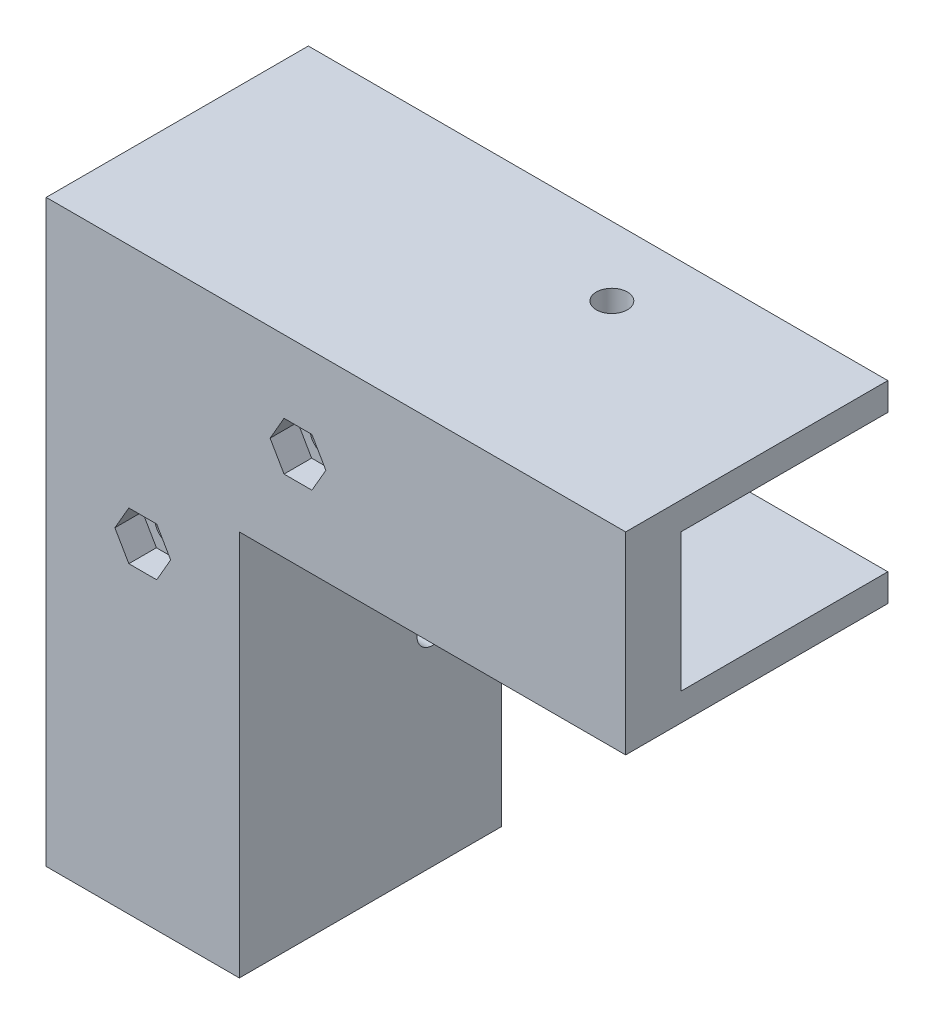
ISO-10303-21;
HEADER;
FILE_DESCRIPTION(('STEP AP214'),'2;1');
FILE_NAME('part.step','',(''),(''),'','','');
FILE_SCHEMA(('AUTOMOTIVE_DESIGN { 1 0 10303 214 1 1 1 1 }'));
ENDSEC;
DATA;
#1=APPLICATION_CONTEXT('core data for automotive mechanical design processes');
#2=APPLICATION_PROTOCOL_DEFINITION('international standard','automotive_design',2000,#1);
#3=PRODUCT_CONTEXT('',#1,'mechanical');
#4=PRODUCT('Part','Part','',(#3));
#5=PRODUCT_RELATED_PRODUCT_CATEGORY('part','',(#4));
#6=PRODUCT_DEFINITION_FORMATION('','',#4);
#7=PRODUCT_DEFINITION_CONTEXT('part definition',#1,'design');
#8=PRODUCT_DEFINITION('design','',#6,#7);
#9=PRODUCT_DEFINITION_SHAPE('','',#8);
#10=(LENGTH_UNIT() NAMED_UNIT(*) SI_UNIT(.MILLI.,.METRE.));
#11=(NAMED_UNIT(*) PLANE_ANGLE_UNIT() SI_UNIT($,.RADIAN.));
#12=(NAMED_UNIT(*) SI_UNIT($,.STERADIAN.) SOLID_ANGLE_UNIT());
#13=UNCERTAINTY_MEASURE_WITH_UNIT(LENGTH_MEASURE(1.E-05),#10,'distance_accuracy_value','');
#14=(GEOMETRIC_REPRESENTATION_CONTEXT(3) GLOBAL_UNCERTAINTY_ASSIGNED_CONTEXT((#13)) GLOBAL_UNIT_ASSIGNED_CONTEXT((#10,
#11,#12)) REPRESENTATION_CONTEXT('',''));
#15=CARTESIAN_POINT('',(0.,0.,0.));
#16=DIRECTION('',(0.,0.,1.));
#17=DIRECTION('',(1.,0.,0.));
#18=AXIS2_PLACEMENT_3D('',#15,#16,#17);
#19=CARTESIAN_POINT('',(0.,0.,8.));
#20=DIRECTION('',(0.,0.,1.));
#21=DIRECTION('',(1.,0.,0.));
#22=AXIS2_PLACEMENT_3D('',#19,#20,#21);
#23=PLANE('',#22);
#24=DIRECTION('',(1.,0.,0.));
#25=VECTOR('',#24,1.);
#26=CARTESIAN_POINT('',(-20.,0.,8.));
#27=LINE('',#26,#25);
#28=CARTESIAN_POINT('',(-24.,0.,8.));
#29=VERTEX_POINT('',#28);
#30=CARTESIAN_POINT('',(4.,0.,8.));
#31=VERTEX_POINT('',#30);
#32=EDGE_CURVE('E395',#29,#31,#27,.T.);
#33=ORIENTED_EDGE('',*,*,#32,.T.);
#34=DIRECTION('',(0.,1.,0.));
#35=VECTOR('',#34,1.);
#36=CARTESIAN_POINT('',(3.99999999999999,56.,8.));
#37=LINE('',#36,#35);
#38=CARTESIAN_POINT('',(3.99999999999999,56.,8.));
#39=VERTEX_POINT('',#38);
#40=EDGE_CURVE('E247',#31,#39,#37,.T.);
#41=ORIENTED_EDGE('',*,*,#40,.T.);
#42=DIRECTION('',(1.,0.,0.));
#43=VECTOR('',#42,1.);
#44=CARTESIAN_POINT('',(60.,56.,8.));
#45=LINE('',#44,#43);
#46=CARTESIAN_POINT('',(60.,56.,8.));
#47=VERTEX_POINT('',#46);
#48=EDGE_CURVE('E261',#39,#47,#45,.T.);
#49=ORIENTED_EDGE('',*,*,#48,.T.);
#50=DIRECTION('',(0.,1.,0.));
#51=VECTOR('',#50,1.);
#52=CARTESIAN_POINT('',(60.,60.,8.));
#53=LINE('',#52,#51);
#54=CARTESIAN_POINT('',(60.,84.,8.));
#55=VERTEX_POINT('',#54);
#56=EDGE_CURVE('E397',#47,#55,#53,.T.);
#57=ORIENTED_EDGE('',*,*,#56,.T.);
#58=DIRECTION('',(-1.,0.,0.));
#59=VECTOR('',#58,1.);
#60=CARTESIAN_POINT('',(60.,84.,8.));
#61=LINE('',#60,#59);
#62=CARTESIAN_POINT('',(-24.,84.,8.));
#63=VERTEX_POINT('',#62);
#64=EDGE_CURVE('E230',#55,#63,#61,.T.);
#65=ORIENTED_EDGE('',*,*,#64,.T.);
#66=DIRECTION('',(0.,-1.,0.));
#67=VECTOR('',#66,1.);
#68=CARTESIAN_POINT('',(-24.,84.,8.));
#69=LINE('',#68,#67);
#70=EDGE_CURVE('E227',#63,#29,#69,.T.);
#71=ORIENTED_EDGE('',*,*,#70,.T.);
#72=EDGE_LOOP('',(#33,#41,#49,#57,#65,#71));
#73=FACE_BOUND('',#72,.T.);
#74=DIRECTION('',(-1.,0.,0.));
#75=VECTOR('',#74,1.);
#76=CARTESIAN_POINT('',(0.,66.5,8.));
#77=LINE('',#76,#75);
#78=CARTESIAN_POINT('',(14.5207259421637,66.5,8.));
#79=VERTEX_POINT('',#78);
#80=CARTESIAN_POINT('',(10.4792740578363,66.5,8.));
#81=VERTEX_POINT('',#80);
#82=EDGE_CURVE('E367',#79,#81,#77,.T.);
#83=ORIENTED_EDGE('',*,*,#82,.T.);
#84=DIRECTION('',(-0.5,0.866025403784439,0.));
#85=VECTOR('',#84,1.);
#86=CARTESIAN_POINT('',(36.6548002192098,21.1626587736527,8.));
#87=LINE('',#86,#85);
#88=CARTESIAN_POINT('',(8.45854811567259,70.,8.));
#89=VERTEX_POINT('',#88);
#90=EDGE_CURVE('E339',#81,#89,#87,.T.);
#91=ORIENTED_EDGE('',*,*,#90,.T.);
#92=DIRECTION('',(0.499999999999996,0.866025403784441,0.));
#93=VECTOR('',#92,1.);
#94=CARTESIAN_POINT('',(-23.9669780457007,13.837341226347,8.));
#95=LINE('',#94,#93);
#96=CARTESIAN_POINT('',(10.4792740578363,73.5,8.));
#97=VERTEX_POINT('',#96);
#98=EDGE_CURVE('E354',#89,#97,#95,.T.);
#99=ORIENTED_EDGE('',*,*,#98,.T.);
#100=DIRECTION('',(1.,0.,0.));
#101=VECTOR('',#100,1.);
#102=CARTESIAN_POINT('',(0.,73.5,8.));
#103=LINE('',#102,#101);
#104=CARTESIAN_POINT('',(14.5207259421637,73.5,8.));
#105=VERTEX_POINT('',#104);
#106=EDGE_CURVE('E376',#97,#105,#103,.T.);
#107=ORIENTED_EDGE('',*,*,#106,.T.);
#108=DIRECTION('',(0.5,-0.866025403784439,0.));
#109=VECTOR('',#108,1.);
#110=CARTESIAN_POINT('',(42.7169780457009,24.6626587736527,8.));
#111=LINE('',#110,#109);
#112=CARTESIAN_POINT('',(16.5414518843274,70.,8.));
#113=VERTEX_POINT('',#112);
#114=EDGE_CURVE('E373',#105,#113,#111,.T.);
#115=ORIENTED_EDGE('',*,*,#114,.T.);
#116=DIRECTION('',(-0.500000000000001,-0.866025403784438,0.));
#117=VECTOR('',#116,1.);
#118=CARTESIAN_POINT('',(-17.9048002192099,10.3373412263473,8.));
#119=LINE('',#118,#117);
#120=EDGE_CURVE('E370',#113,#79,#119,.T.);
#121=ORIENTED_EDGE('',*,*,#120,.T.);
#122=EDGE_LOOP('',(#83,#91,#99,#107,#115,#121));
#123=FACE_BOUND('',#122,.T.);
#124=DIRECTION('',(-1.,0.,0.));
#125=VECTOR('',#124,1.);
#126=CARTESIAN_POINT('',(0.,44.,8.));
#127=LINE('',#126,#125);
#128=CARTESIAN_POINT('',(-7.97927405783629,44.,8.));
#129=VERTEX_POINT('',#128);
#130=CARTESIAN_POINT('',(-12.0207259421637,44.,8.));
#131=VERTEX_POINT('',#130);
#132=EDGE_CURVE('E322',#129,#131,#127,.T.);
#133=ORIENTED_EDGE('',*,*,#132,.T.);
#134=DIRECTION('',(-0.5,0.866025403784439,0.));
#135=VECTOR('',#134,1.);
#136=CARTESIAN_POINT('',(10.0370144266349,5.79487298107779,8.));
#137=LINE('',#136,#135);
#138=CARTESIAN_POINT('',(-14.0414518843274,47.5,8.));
#139=VERTEX_POINT('',#138);
#140=EDGE_CURVE('E302',#131,#139,#137,.T.);
#141=ORIENTED_EDGE('',*,*,#140,.T.);
#142=DIRECTION('',(0.5,0.866025403784438,0.));
#143=VECTOR('',#142,1.);
#144=CARTESIAN_POINT('',(-31.099192253126,17.9551270189222,8.));
#145=LINE('',#144,#143);
#146=CARTESIAN_POINT('',(-12.0207259421637,51.,8.));
#147=VERTEX_POINT('',#146);
#148=EDGE_CURVE('E309',#139,#147,#145,.T.);
#149=ORIENTED_EDGE('',*,*,#148,.T.);
#150=DIRECTION('',(1.,0.,0.));
#151=VECTOR('',#150,1.);
#152=CARTESIAN_POINT('',(-1.75126958938504E-13,51.,8.));
#153=LINE('',#152,#151);
#154=CARTESIAN_POINT('',(-7.97927405783632,51.,8.));
#155=VERTEX_POINT('',#154);
#156=EDGE_CURVE('E331',#147,#155,#153,.T.);
#157=ORIENTED_EDGE('',*,*,#156,.T.);
#158=DIRECTION('',(0.5,-0.866025403784439,0.));
#159=VECTOR('',#158,1.);
#160=CARTESIAN_POINT('',(16.0991922531259,9.29487298107778,8.));
#161=LINE('',#160,#159);
#162=CARTESIAN_POINT('',(-5.95854811567261,47.5,8.));
#163=VERTEX_POINT('',#162);
#164=EDGE_CURVE('E328',#155,#163,#161,.T.);
#165=ORIENTED_EDGE('',*,*,#164,.T.);
#166=DIRECTION('',(-0.499999999999999,-0.866025403784439,0.));
#167=VECTOR('',#166,1.);
#168=CARTESIAN_POINT('',(-25.0370144266349,14.4551270189221,8.));
#169=LINE('',#168,#167);
#170=EDGE_CURVE('E325',#163,#129,#169,.T.);
#171=ORIENTED_EDGE('',*,*,#170,.T.);
#172=EDGE_LOOP('',(#133,#141,#149,#157,#165,#171));
#173=FACE_BOUND('',#172,.T.);
#174=ADVANCED_FACE('F33',(#73,#123,#173),#23,.T.);
#175=CARTESIAN_POINT('',(-20.,0.,8.));
#176=DIRECTION('',(0.,1.,0.));
#177=DIRECTION('',(0.,0.,1.));
#178=AXIS2_PLACEMENT_3D('',#175,#176,#177);
#179=PLANE('',#178);
#180=DIRECTION('',(1.,0.,0.));
#181=VECTOR('',#180,1.);
#182=CARTESIAN_POINT('',(-20.,0.,0.));
#183=LINE('',#182,#181);
#184=CARTESIAN_POINT('',(-20.,0.,0.));
#185=VERTEX_POINT('',#184);
#186=CARTESIAN_POINT('',(0.,0.,0.));
#187=VERTEX_POINT('',#186);
#188=EDGE_CURVE('E384',#185,#187,#183,.T.);
#189=ORIENTED_EDGE('',*,*,#188,.T.);
#190=DIRECTION('',(0.,0.,1.));
#191=VECTOR('',#190,1.);
#192=CARTESIAN_POINT('',(0.,0.,-30.));
#193=LINE('',#192,#191);
#194=CARTESIAN_POINT('',(0.,0.,-30.));
#195=VERTEX_POINT('',#194);
#196=EDGE_CURVE('E280',#195,#187,#193,.T.);
#197=ORIENTED_EDGE('',*,*,#196,.F.);
#198=DIRECTION('',(1.,0.,0.));
#199=VECTOR('',#198,1.);
#200=CARTESIAN_POINT('',(4.,0.,-30.));
#201=LINE('',#200,#199);
#202=CARTESIAN_POINT('',(4.,0.,-30.));
#203=VERTEX_POINT('',#202);
#204=EDGE_CURVE('E257',#195,#203,#201,.T.);
#205=ORIENTED_EDGE('',*,*,#204,.T.);
#206=DIRECTION('',(0.,0.,1.));
#207=VECTOR('',#206,1.);
#208=CARTESIAN_POINT('',(4.,0.,-30.));
#209=LINE('',#208,#207);
#210=EDGE_CURVE('E275',#203,#31,#209,.T.);
#211=ORIENTED_EDGE('',*,*,#210,.T.);
#212=ORIENTED_EDGE('',*,*,#32,.F.);
#213=DIRECTION('',(0.,0.,1.));
#214=VECTOR('',#213,1.);
#215=CARTESIAN_POINT('',(-24.,0.,-30.));
#216=LINE('',#215,#214);
#217=CARTESIAN_POINT('',(-24.,0.,-30.));
#218=VERTEX_POINT('',#217);
#219=EDGE_CURVE('E251',#218,#29,#216,.T.);
#220=ORIENTED_EDGE('',*,*,#219,.F.);
#221=DIRECTION('',(1.,0.,0.));
#222=VECTOR('',#221,1.);
#223=CARTESIAN_POINT('',(-24.,0.,-30.));
#224=LINE('',#223,#222);
#225=CARTESIAN_POINT('',(-20.,0.,-30.));
#226=VERTEX_POINT('',#225);
#227=EDGE_CURVE('E240',#218,#226,#224,.T.);
#228=ORIENTED_EDGE('',*,*,#227,.T.);
#229=DIRECTION('',(0.,0.,1.));
#230=VECTOR('',#229,1.);
#231=CARTESIAN_POINT('',(-20.,0.,-30.));
#232=LINE('',#231,#230);
#233=EDGE_CURVE('E248',#226,#185,#232,.T.);
#234=ORIENTED_EDGE('',*,*,#233,.T.);
#235=EDGE_LOOP('',(#189,#197,#205,#211,#212,#220,#228,#234));
#236=FACE_BOUND('',#235,.T.);
#237=ADVANCED_FACE('F433',(#236),#179,.F.);
#238=CARTESIAN_POINT('',(60.,60.,8.));
#239=DIRECTION('',(-1.,0.,0.));
#240=DIRECTION('',(0.,0.,1.));
#241=AXIS2_PLACEMENT_3D('',#238,#239,#240);
#242=PLANE('',#241);
#243=DIRECTION('',(0.,1.,0.));
#244=VECTOR('',#243,1.);
#245=CARTESIAN_POINT('',(60.,60.,0.));
#246=LINE('',#245,#244);
#247=CARTESIAN_POINT('',(60.,60.,0.));
#248=VERTEX_POINT('',#247);
#249=CARTESIAN_POINT('',(60.,80.,0.));
#250=VERTEX_POINT('',#249);
#251=EDGE_CURVE('E205',#248,#250,#246,.T.);
#252=ORIENTED_EDGE('',*,*,#251,.T.);
#253=DIRECTION('',(0.,0.,1.));
#254=VECTOR('',#253,1.);
#255=CARTESIAN_POINT('',(60.,80.,-30.));
#256=LINE('',#255,#254);
#257=CARTESIAN_POINT('',(60.,80.,-30.));
#258=VERTEX_POINT('',#257);
#259=EDGE_CURVE('E198',#258,#250,#256,.T.);
#260=ORIENTED_EDGE('',*,*,#259,.F.);
#261=DIRECTION('',(0.,1.,0.));
#262=VECTOR('',#261,1.);
#263=CARTESIAN_POINT('',(60.,80.,-30.));
#264=LINE('',#263,#262);
#265=CARTESIAN_POINT('',(60.,84.,-30.));
#266=VERTEX_POINT('',#265);
#267=EDGE_CURVE('E202',#258,#266,#264,.T.);
#268=ORIENTED_EDGE('',*,*,#267,.T.);
#269=DIRECTION('',(0.,0.,1.));
#270=VECTOR('',#269,1.);
#271=CARTESIAN_POINT('',(60.,84.,-30.));
#272=LINE('',#271,#270);
#273=EDGE_CURVE('E210',#266,#55,#272,.T.);
#274=ORIENTED_EDGE('',*,*,#273,.T.);
#275=ORIENTED_EDGE('',*,*,#56,.F.);
#276=DIRECTION('',(0.,0.,1.));
#277=VECTOR('',#276,1.);
#278=CARTESIAN_POINT('',(60.,56.,-30.));
#279=LINE('',#278,#277);
#280=CARTESIAN_POINT('',(60.,56.,-30.));
#281=VERTEX_POINT('',#280);
#282=EDGE_CURVE('E286',#281,#47,#279,.T.);
#283=ORIENTED_EDGE('',*,*,#282,.F.);
#284=DIRECTION('',(0.,1.,0.));
#285=VECTOR('',#284,1.);
#286=CARTESIAN_POINT('',(60.,60.,-30.));
#287=LINE('',#286,#285);
#288=CARTESIAN_POINT('',(60.,60.,-30.));
#289=VERTEX_POINT('',#288);
#290=EDGE_CURVE('E267',#281,#289,#287,.T.);
#291=ORIENTED_EDGE('',*,*,#290,.T.);
#292=DIRECTION('',(0.,0.,1.));
#293=VECTOR('',#292,1.);
#294=CARTESIAN_POINT('',(60.,60.,-30.));
#295=LINE('',#294,#293);
#296=EDGE_CURVE('E284',#289,#248,#295,.T.);
#297=ORIENTED_EDGE('',*,*,#296,.T.);
#298=EDGE_LOOP('',(#252,#260,#268,#274,#275,#283,#291,#297));
#299=FACE_BOUND('',#298,.T.);
#300=ADVANCED_FACE('F200',(#299),#242,.F.);
#301=CARTESIAN_POINT('',(0.,0.,0.));
#302=DIRECTION('',(0.,0.,1.));
#303=DIRECTION('',(1.,0.,0.));
#304=AXIS2_PLACEMENT_3D('',#301,#302,#303);
#305=PLANE('',#304);
#306=CARTESIAN_POINT('',(12.5,70.,0.));
#307=DIRECTION('',(0.,0.,1.));
#308=DIRECTION('',(1.,0.,0.));
#309=AXIS2_PLACEMENT_3D('',#306,#307,#308);
#310=CIRCLE('',#309,2.25);
#311=CARTESIAN_POINT('',(14.75,70.,0.));
#312=VERTEX_POINT('',#311);
#313=EDGE_CURVE('E293',#312,#312,#310,.T.);
#314=ORIENTED_EDGE('',*,*,#313,.T.);
#315=EDGE_LOOP('',(#314));
#316=FACE_BOUND('',#315,.T.);
#317=CARTESIAN_POINT('',(-10.,47.5,0.));
#318=DIRECTION('',(0.,0.,1.));
#319=DIRECTION('',(1.,0.,0.));
#320=AXIS2_PLACEMENT_3D('',#317,#318,#319);
#321=CIRCLE('',#320,2.25);
#322=CARTESIAN_POINT('',(-7.75,47.5,0.));
#323=VERTEX_POINT('',#322);
#324=EDGE_CURVE('E299',#323,#323,#321,.T.);
#325=ORIENTED_EDGE('',*,*,#324,.T.);
#326=EDGE_LOOP('',(#325));
#327=FACE_BOUND('',#326,.T.);
#328=ORIENTED_EDGE('',*,*,#188,.F.);
#329=DIRECTION('',(0.,-1.,0.));
#330=VECTOR('',#329,1.);
#331=CARTESIAN_POINT('',(-20.,80.,0.));
#332=LINE('',#331,#330);
#333=CARTESIAN_POINT('',(-20.,80.,0.));
#334=VERTEX_POINT('',#333);
#335=EDGE_CURVE('E398',#334,#185,#332,.T.);
#336=ORIENTED_EDGE('',*,*,#335,.F.);
#337=DIRECTION('',(-1.,0.,0.));
#338=VECTOR('',#337,1.);
#339=CARTESIAN_POINT('',(60.,80.,0.));
#340=LINE('',#339,#338);
#341=EDGE_CURVE('E408',#250,#334,#340,.T.);
#342=ORIENTED_EDGE('',*,*,#341,.F.);
#343=ORIENTED_EDGE('',*,*,#251,.F.);
#344=DIRECTION('',(1.,0.,0.));
#345=VECTOR('',#344,1.);
#346=CARTESIAN_POINT('',(0.,60.,0.));
#347=LINE('',#346,#345);
#348=CARTESIAN_POINT('',(6.,60.,0.));
#349=VERTEX_POINT('',#348);
#350=EDGE_CURVE('E405',#349,#248,#347,.T.);
#351=ORIENTED_EDGE('',*,*,#350,.F.);
#352=CARTESIAN_POINT('',(6.,54.,0.));
#353=DIRECTION('',(0.,0.,1.));
#354=DIRECTION('',(1.,0.,0.));
#355=AXIS2_PLACEMENT_3D('',#352,#353,#354);
#356=CIRCLE('',#355,6.);
#357=CARTESIAN_POINT('',(0.,54.,0.));
#358=VERTEX_POINT('',#357);
#359=EDGE_CURVE('E11',#349,#358,#356,.T.);
#360=ORIENTED_EDGE('',*,*,#359,.T.);
#361=DIRECTION('',(0.,1.,0.));
#362=VECTOR('',#361,1.);
#363=CARTESIAN_POINT('',(0.,0.,0.));
#364=LINE('',#363,#362);
#365=EDGE_CURVE('E403',#187,#358,#364,.T.);
#366=ORIENTED_EDGE('',*,*,#365,.F.);
#367=EDGE_LOOP('',(#328,#336,#342,#343,#351,#360,#366));
#368=FACE_BOUND('',#367,.T.);
#369=ADVANCED_FACE('F445',(#316,#327,#368),#305,.F.);
#370=CARTESIAN_POINT('',(36.6548002192098,21.1626587736527,4.));
#371=DIRECTION('',(0.866025403784439,0.5,0.));
#372=DIRECTION('',(-0.5,0.866025403784439,0.));
#373=AXIS2_PLACEMENT_3D('',#370,#371,#372);
#374=PLANE('',#373);
#375=ORIENTED_EDGE('',*,*,#90,.F.);
#376=DIRECTION('',(0.,0.,1.));
#377=VECTOR('',#376,1.);
#378=CARTESIAN_POINT('',(10.4792740578363,66.5,4.));
#379=LINE('',#378,#377);
#380=CARTESIAN_POINT('',(10.4792740578363,66.5,4.));
#381=VERTEX_POINT('',#380);
#382=EDGE_CURVE('E364',#381,#81,#379,.T.);
#383=ORIENTED_EDGE('',*,*,#382,.F.);
#384=DIRECTION('',(-0.5,0.866025403784439,0.));
#385=VECTOR('',#384,1.);
#386=CARTESIAN_POINT('',(36.6548002192098,21.1626587736527,4.));
#387=LINE('',#386,#385);
#388=CARTESIAN_POINT('',(8.45854811567259,70.,4.));
#389=VERTEX_POINT('',#388);
#390=EDGE_CURVE('E350',#381,#389,#387,.T.);
#391=ORIENTED_EDGE('',*,*,#390,.T.);
#392=DIRECTION('',(0.,0.,1.));
#393=VECTOR('',#392,1.);
#394=CARTESIAN_POINT('',(8.45854811567259,70.,4.));
#395=LINE('',#394,#393);
#396=EDGE_CURVE('E381',#389,#89,#395,.T.);
#397=ORIENTED_EDGE('',*,*,#396,.T.);
#398=EDGE_LOOP('',(#375,#383,#391,#397));
#399=FACE_BOUND('',#398,.T.);
#400=ADVANCED_FACE('F443',(#399),#374,.T.);
#401=CARTESIAN_POINT('',(-23.9669780457007,13.837341226347,4.));
#402=DIRECTION('',(0.866025403784441,-0.499999999999996,0.));
#403=DIRECTION('',(0.499999999999996,0.866025403784441,0.));
#404=AXIS2_PLACEMENT_3D('',#401,#402,#403);
#405=PLANE('',#404);
#406=ORIENTED_EDGE('',*,*,#98,.F.);
#407=ORIENTED_EDGE('',*,*,#396,.F.);
#408=DIRECTION('',(0.499999999999996,0.866025403784441,0.));
#409=VECTOR('',#408,1.);
#410=CARTESIAN_POINT('',(-23.9669780457007,13.837341226347,4.));
#411=LINE('',#410,#409);
#412=CARTESIAN_POINT('',(10.4792740578363,73.5,4.));
#413=VERTEX_POINT('',#412);
#414=EDGE_CURVE('E362',#389,#413,#411,.T.);
#415=ORIENTED_EDGE('',*,*,#414,.T.);
#416=DIRECTION('',(0.,0.,1.));
#417=VECTOR('',#416,1.);
#418=CARTESIAN_POINT('',(10.4792740578363,73.5,4.));
#419=LINE('',#418,#417);
#420=EDGE_CURVE('E385',#413,#97,#419,.T.);
#421=ORIENTED_EDGE('',*,*,#420,.T.);
#422=EDGE_LOOP('',(#406,#407,#415,#421));
#423=FACE_BOUND('',#422,.T.);
#424=ADVANCED_FACE('F467',(#423),#405,.T.);
#425=CARTESIAN_POINT('',(0.,73.5,4.));
#426=DIRECTION('',(0.,-1.,0.));
#427=DIRECTION('',(0.,0.,-1.));
#428=AXIS2_PLACEMENT_3D('',#425,#426,#427);
#429=PLANE('',#428);
#430=ORIENTED_EDGE('',*,*,#106,.F.);
#431=ORIENTED_EDGE('',*,*,#420,.F.);
#432=DIRECTION('',(1.,0.,0.));
#433=VECTOR('',#432,1.);
#434=CARTESIAN_POINT('',(0.,73.5,4.));
#435=LINE('',#434,#433);
#436=CARTESIAN_POINT('',(14.5207259421637,73.5,4.));
#437=VERTEX_POINT('',#436);
#438=EDGE_CURVE('E360',#413,#437,#435,.T.);
#439=ORIENTED_EDGE('',*,*,#438,.T.);
#440=DIRECTION('',(0.,0.,1.));
#441=VECTOR('',#440,1.);
#442=CARTESIAN_POINT('',(14.5207259421637,73.5,4.));
#443=LINE('',#442,#441);
#444=EDGE_CURVE('E387',#437,#105,#443,.T.);
#445=ORIENTED_EDGE('',*,*,#444,.T.);
#446=EDGE_LOOP('',(#430,#431,#439,#445));
#447=FACE_BOUND('',#446,.T.);
#448=ADVANCED_FACE('F474',(#447),#429,.T.);
#449=CARTESIAN_POINT('',(42.7169780457009,24.6626587736527,4.));
#450=DIRECTION('',(-0.866025403784439,-0.5,0.));
#451=DIRECTION('',(0.5,-0.866025403784439,0.));
#452=AXIS2_PLACEMENT_3D('',#449,#450,#451);
#453=PLANE('',#452);
#454=ORIENTED_EDGE('',*,*,#114,.F.);
#455=ORIENTED_EDGE('',*,*,#444,.F.);
#456=DIRECTION('',(0.5,-0.866025403784439,0.));
#457=VECTOR('',#456,1.);
#458=CARTESIAN_POINT('',(42.7169780457009,24.6626587736527,4.));
#459=LINE('',#458,#457);
#460=CARTESIAN_POINT('',(16.5414518843274,70.,4.));
#461=VERTEX_POINT('',#460);
#462=EDGE_CURVE('E358',#437,#461,#459,.T.);
#463=ORIENTED_EDGE('',*,*,#462,.T.);
#464=DIRECTION('',(0.,0.,1.));
#465=VECTOR('',#464,1.);
#466=CARTESIAN_POINT('',(16.5414518843274,70.,4.));
#467=LINE('',#466,#465);
#468=EDGE_CURVE('E389',#461,#113,#467,.T.);
#469=ORIENTED_EDGE('',*,*,#468,.T.);
#470=EDGE_LOOP('',(#454,#455,#463,#469));
#471=FACE_BOUND('',#470,.T.);
#472=ADVANCED_FACE('F482',(#471),#453,.T.);
#473=CARTESIAN_POINT('',(-17.9048002192099,10.3373412263473,4.));
#474=DIRECTION('',(-0.866025403784438,0.500000000000001,0.));
#475=DIRECTION('',(-0.500000000000001,-0.866025403784438,0.));
#476=AXIS2_PLACEMENT_3D('',#473,#474,#475);
#477=PLANE('',#476);
#478=ORIENTED_EDGE('',*,*,#120,.F.);
#479=ORIENTED_EDGE('',*,*,#468,.F.);
#480=DIRECTION('',(-0.500000000000001,-0.866025403784438,0.));
#481=VECTOR('',#480,1.);
#482=CARTESIAN_POINT('',(-17.9048002192099,10.3373412263473,4.));
#483=LINE('',#482,#481);
#484=CARTESIAN_POINT('',(14.5207259421637,66.5,4.));
#485=VERTEX_POINT('',#484);
#486=EDGE_CURVE('E356',#461,#485,#483,.T.);
#487=ORIENTED_EDGE('',*,*,#486,.T.);
#488=DIRECTION('',(0.,0.,1.));
#489=VECTOR('',#488,1.);
#490=CARTESIAN_POINT('',(14.5207259421637,66.5,4.));
#491=LINE('',#490,#489);
#492=EDGE_CURVE('E391',#485,#79,#491,.T.);
#493=ORIENTED_EDGE('',*,*,#492,.T.);
#494=EDGE_LOOP('',(#478,#479,#487,#493));
#495=FACE_BOUND('',#494,.T.);
#496=ADVANCED_FACE('F490',(#495),#477,.T.);
#497=CARTESIAN_POINT('',(0.,66.5,4.));
#498=DIRECTION('',(0.,1.,0.));
#499=DIRECTION('',(0.,0.,1.));
#500=AXIS2_PLACEMENT_3D('',#497,#498,#499);
#501=PLANE('',#500);
#502=ORIENTED_EDGE('',*,*,#82,.F.);
#503=ORIENTED_EDGE('',*,*,#492,.F.);
#504=DIRECTION('',(-1.,0.,0.));
#505=VECTOR('',#504,1.);
#506=CARTESIAN_POINT('',(0.,66.5,4.));
#507=LINE('',#506,#505);
#508=EDGE_CURVE('E353',#485,#381,#507,.T.);
#509=ORIENTED_EDGE('',*,*,#508,.T.);
#510=ORIENTED_EDGE('',*,*,#382,.T.);
#511=EDGE_LOOP('',(#502,#503,#509,#510));
#512=FACE_BOUND('',#511,.T.);
#513=ADVANCED_FACE('F498',(#512),#501,.T.);
#514=CARTESIAN_POINT('',(0.,0.,4.));
#515=DIRECTION('',(0.,0.,1.));
#516=DIRECTION('',(1.,0.,0.));
#517=AXIS2_PLACEMENT_3D('',#514,#515,#516);
#518=PLANE('',#517);
#519=CARTESIAN_POINT('',(12.5,70.,4.));
#520=DIRECTION('',(0.,0.,1.));
#521=DIRECTION('',(1.,0.,0.));
#522=AXIS2_PLACEMENT_3D('',#519,#520,#521);
#523=CIRCLE('',#522,2.25);
#524=CARTESIAN_POINT('',(14.75,70.,4.));
#525=VERTEX_POINT('',#524);
#526=EDGE_CURVE('E283',#525,#525,#523,.T.);
#527=ORIENTED_EDGE('',*,*,#526,.F.);
#528=EDGE_LOOP('',(#527));
#529=FACE_BOUND('',#528,.T.);
#530=ORIENTED_EDGE('',*,*,#390,.F.);
#531=ORIENTED_EDGE('',*,*,#508,.F.);
#532=ORIENTED_EDGE('',*,*,#486,.F.);
#533=ORIENTED_EDGE('',*,*,#462,.F.);
#534=ORIENTED_EDGE('',*,*,#438,.F.);
#535=ORIENTED_EDGE('',*,*,#414,.F.);
#536=EDGE_LOOP('',(#530,#531,#532,#533,#534,#535));
#537=FACE_BOUND('',#536,.T.);
#538=ADVANCED_FACE('F506',(#529,#537),#518,.T.);
#539=CARTESIAN_POINT('',(10.0370144266349,5.79487298107779,4.));
#540=DIRECTION('',(0.866025403784439,0.5,0.));
#541=DIRECTION('',(-0.5,0.866025403784439,0.));
#542=AXIS2_PLACEMENT_3D('',#539,#540,#541);
#543=PLANE('',#542);
#544=ORIENTED_EDGE('',*,*,#140,.F.);
#545=DIRECTION('',(0.,0.,1.));
#546=VECTOR('',#545,1.);
#547=CARTESIAN_POINT('',(-12.0207259421637,44.,4.));
#548=LINE('',#547,#546);
#549=CARTESIAN_POINT('',(-12.0207259421637,44.,4.));
#550=VERTEX_POINT('',#549);
#551=EDGE_CURVE('E319',#550,#131,#548,.T.);
#552=ORIENTED_EDGE('',*,*,#551,.F.);
#553=DIRECTION('',(-0.5,0.866025403784439,0.));
#554=VECTOR('',#553,1.);
#555=CARTESIAN_POINT('',(10.0370144266349,5.79487298107779,4.));
#556=LINE('',#555,#554);
#557=CARTESIAN_POINT('',(-14.0414518843274,47.5,4.));
#558=VERTEX_POINT('',#557);
#559=EDGE_CURVE('E305',#550,#558,#556,.T.);
#560=ORIENTED_EDGE('',*,*,#559,.T.);
#561=DIRECTION('',(0.,0.,1.));
#562=VECTOR('',#561,1.);
#563=CARTESIAN_POINT('',(-14.0414518843274,47.5,4.));
#564=LINE('',#563,#562);
#565=EDGE_CURVE('E336',#558,#139,#564,.T.);
#566=ORIENTED_EDGE('',*,*,#565,.T.);
#567=EDGE_LOOP('',(#544,#552,#560,#566));
#568=FACE_BOUND('',#567,.T.);
#569=ADVANCED_FACE('F514',(#568),#543,.T.);
#570=CARTESIAN_POINT('',(-31.099192253126,17.9551270189222,4.));
#571=DIRECTION('',(0.866025403784438,-0.5,0.));
#572=DIRECTION('',(0.5,0.866025403784438,0.));
#573=AXIS2_PLACEMENT_3D('',#570,#571,#572);
#574=PLANE('',#573);
#575=ORIENTED_EDGE('',*,*,#148,.F.);
#576=ORIENTED_EDGE('',*,*,#565,.F.);
#577=DIRECTION('',(0.5,0.866025403784438,0.));
#578=VECTOR('',#577,1.);
#579=CARTESIAN_POINT('',(-31.099192253126,17.9551270189222,4.));
#580=LINE('',#579,#578);
#581=CARTESIAN_POINT('',(-12.0207259421637,51.,4.));
#582=VERTEX_POINT('',#581);
#583=EDGE_CURVE('E317',#558,#582,#580,.T.);
#584=ORIENTED_EDGE('',*,*,#583,.T.);
#585=DIRECTION('',(0.,0.,1.));
#586=VECTOR('',#585,1.);
#587=CARTESIAN_POINT('',(-12.0207259421637,51.,4.));
#588=LINE('',#587,#586);
#589=EDGE_CURVE('E340',#582,#147,#588,.T.);
#590=ORIENTED_EDGE('',*,*,#589,.T.);
#591=EDGE_LOOP('',(#575,#576,#584,#590));
#592=FACE_BOUND('',#591,.T.);
#593=ADVANCED_FACE('F523',(#592),#574,.T.);
#594=CARTESIAN_POINT('',(-1.75126958938504E-13,51.,4.));
#595=DIRECTION('',(0.,-1.,0.));
#596=DIRECTION('',(1.,0.,0.));
#597=AXIS2_PLACEMENT_3D('',#594,#595,#596);
#598=PLANE('',#597);
#599=ORIENTED_EDGE('',*,*,#156,.F.);
#600=ORIENTED_EDGE('',*,*,#589,.F.);
#601=DIRECTION('',(1.,0.,0.));
#602=VECTOR('',#601,1.);
#603=CARTESIAN_POINT('',(-1.75126958938504E-13,51.,4.));
#604=LINE('',#603,#602);
#605=CARTESIAN_POINT('',(-7.97927405783632,51.,4.));
#606=VERTEX_POINT('',#605);
#607=EDGE_CURVE('E315',#582,#606,#604,.T.);
#608=ORIENTED_EDGE('',*,*,#607,.T.);
#609=DIRECTION('',(0.,0.,1.));
#610=VECTOR('',#609,1.);
#611=CARTESIAN_POINT('',(-7.97927405783632,51.,4.));
#612=LINE('',#611,#610);
#613=EDGE_CURVE('E342',#606,#155,#612,.T.);
#614=ORIENTED_EDGE('',*,*,#613,.T.);
#615=EDGE_LOOP('',(#599,#600,#608,#614));
#616=FACE_BOUND('',#615,.T.);
#617=ADVANCED_FACE('F531',(#616),#598,.T.);
#618=CARTESIAN_POINT('',(16.0991922531259,9.29487298107778,4.));
#619=DIRECTION('',(-0.866025403784439,-0.499999999999999,0.));
#620=DIRECTION('',(0.5,-0.866025403784439,0.));
#621=AXIS2_PLACEMENT_3D('',#618,#619,#620);
#622=PLANE('',#621);
#623=ORIENTED_EDGE('',*,*,#164,.F.);
#624=ORIENTED_EDGE('',*,*,#613,.F.);
#625=DIRECTION('',(0.5,-0.866025403784439,0.));
#626=VECTOR('',#625,1.);
#627=CARTESIAN_POINT('',(16.0991922531259,9.29487298107778,4.));
#628=LINE('',#627,#626);
#629=CARTESIAN_POINT('',(-5.95854811567261,47.5,4.));
#630=VERTEX_POINT('',#629);
#631=EDGE_CURVE('E313',#606,#630,#628,.T.);
#632=ORIENTED_EDGE('',*,*,#631,.T.);
#633=DIRECTION('',(0.,0.,1.));
#634=VECTOR('',#633,1.);
#635=CARTESIAN_POINT('',(-5.95854811567261,47.5,4.));
#636=LINE('',#635,#634);
#637=EDGE_CURVE('E344',#630,#163,#636,.T.);
#638=ORIENTED_EDGE('',*,*,#637,.T.);
#639=EDGE_LOOP('',(#623,#624,#632,#638));
#640=FACE_BOUND('',#639,.T.);
#641=ADVANCED_FACE('F539',(#640),#622,.T.);
#642=CARTESIAN_POINT('',(-25.0370144266349,14.4551270189221,4.));
#643=DIRECTION('',(-0.866025403784439,0.499999999999999,0.));
#644=DIRECTION('',(-0.499999999999999,-0.866025403784439,0.));
#645=AXIS2_PLACEMENT_3D('',#642,#643,#644);
#646=PLANE('',#645);
#647=ORIENTED_EDGE('',*,*,#170,.F.);
#648=ORIENTED_EDGE('',*,*,#637,.F.);
#649=DIRECTION('',(-0.499999999999999,-0.866025403784439,0.));
#650=VECTOR('',#649,1.);
#651=CARTESIAN_POINT('',(-25.0370144266349,14.4551270189221,4.));
#652=LINE('',#651,#650);
#653=CARTESIAN_POINT('',(-7.97927405783629,44.,4.));
#654=VERTEX_POINT('',#653);
#655=EDGE_CURVE('E311',#630,#654,#652,.T.);
#656=ORIENTED_EDGE('',*,*,#655,.T.);
#657=DIRECTION('',(0.,0.,1.));
#658=VECTOR('',#657,1.);
#659=CARTESIAN_POINT('',(-7.97927405783629,44.,4.));
#660=LINE('',#659,#658);
#661=EDGE_CURVE('E346',#654,#129,#660,.T.);
#662=ORIENTED_EDGE('',*,*,#661,.T.);
#663=EDGE_LOOP('',(#647,#648,#656,#662));
#664=FACE_BOUND('',#663,.T.);
#665=ADVANCED_FACE('F547',(#664),#646,.T.);
#666=CARTESIAN_POINT('',(0.,44.,4.));
#667=DIRECTION('',(0.,1.,0.));
#668=DIRECTION('',(-1.,0.,0.));
#669=AXIS2_PLACEMENT_3D('',#666,#667,#668);
#670=PLANE('',#669);
#671=ORIENTED_EDGE('',*,*,#132,.F.);
#672=ORIENTED_EDGE('',*,*,#661,.F.);
#673=DIRECTION('',(-1.,0.,0.));
#674=VECTOR('',#673,1.);
#675=CARTESIAN_POINT('',(0.,44.,4.));
#676=LINE('',#675,#674);
#677=EDGE_CURVE('E308',#654,#550,#676,.T.);
#678=ORIENTED_EDGE('',*,*,#677,.T.);
#679=ORIENTED_EDGE('',*,*,#551,.T.);
#680=EDGE_LOOP('',(#671,#672,#678,#679));
#681=FACE_BOUND('',#680,.T.);
#682=ADVANCED_FACE('F555',(#681),#670,.T.);
#683=CARTESIAN_POINT('',(0.,0.,4.));
#684=DIRECTION('',(0.,0.,1.));
#685=DIRECTION('',(1.,0.,0.));
#686=AXIS2_PLACEMENT_3D('',#683,#684,#685);
#687=PLANE('',#686);
#688=CARTESIAN_POINT('',(-10.,47.5,4.));
#689=DIRECTION('',(0.,0.,1.));
#690=DIRECTION('',(1.,0.,0.));
#691=AXIS2_PLACEMENT_3D('',#688,#689,#690);
#692=CIRCLE('',#691,2.25);
#693=CARTESIAN_POINT('',(-7.75,47.5,4.));
#694=VERTEX_POINT('',#693);
#695=EDGE_CURVE('E296',#694,#694,#692,.T.);
#696=ORIENTED_EDGE('',*,*,#695,.F.);
#697=EDGE_LOOP('',(#696));
#698=FACE_BOUND('',#697,.T.);
#699=ORIENTED_EDGE('',*,*,#559,.F.);
#700=ORIENTED_EDGE('',*,*,#677,.F.);
#701=ORIENTED_EDGE('',*,*,#655,.F.);
#702=ORIENTED_EDGE('',*,*,#631,.F.);
#703=ORIENTED_EDGE('',*,*,#607,.F.);
#704=ORIENTED_EDGE('',*,*,#583,.F.);
#705=EDGE_LOOP('',(#699,#700,#701,#702,#703,#704));
#706=FACE_BOUND('',#705,.T.);
#707=ADVANCED_FACE('F562',(#698,#706),#687,.T.);
#708=CARTESIAN_POINT('',(-10.,47.5,0.));
#709=DIRECTION('',(0.,0.,1.));
#710=DIRECTION('',(1.,0.,0.));
#711=AXIS2_PLACEMENT_3D('',#708,#709,#710);
#712=CYLINDRICAL_SURFACE('',#711,2.25);
#713=ORIENTED_EDGE('',*,*,#324,.F.);
#714=EDGE_LOOP('',(#713));
#715=FACE_BOUND('',#714,.T.);
#716=ORIENTED_EDGE('',*,*,#695,.T.);
#717=EDGE_LOOP('',(#716));
#718=FACE_BOUND('',#717,.T.);
#719=ADVANCED_FACE('F569',(#715,#718),#712,.F.);
#720=CARTESIAN_POINT('',(12.5,70.,0.));
#721=DIRECTION('',(0.,0.,1.));
#722=DIRECTION('',(1.,0.,0.));
#723=AXIS2_PLACEMENT_3D('',#720,#721,#722);
#724=CYLINDRICAL_SURFACE('',#723,2.25);
#725=ORIENTED_EDGE('',*,*,#313,.F.);
#726=EDGE_LOOP('',(#725));
#727=FACE_BOUND('',#726,.T.);
#728=ORIENTED_EDGE('',*,*,#526,.T.);
#729=EDGE_LOOP('',(#728));
#730=FACE_BOUND('',#729,.T.);
#731=ADVANCED_FACE('F577',(#727,#730),#724,.F.);
#732=CARTESIAN_POINT('',(0.,0.,-30.));
#733=DIRECTION('',(-1.,0.,0.));
#734=DIRECTION('',(0.,0.,1.));
#735=AXIS2_PLACEMENT_3D('',#732,#733,#734);
#736=PLANE('',#735);
#737=CARTESIAN_POINT('',(0.,30.,-20.));
#738=DIRECTION('',(-1.,0.,0.));
#739=DIRECTION('',(0.,0.,1.));
#740=AXIS2_PLACEMENT_3D('',#737,#738,#739);
#741=CIRCLE('',#740,2.25);
#742=CARTESIAN_POINT('',(0.,30.,-17.75));
#743=VERTEX_POINT('',#742);
#744=EDGE_CURVE('E787',#743,#743,#741,.T.);
#745=ORIENTED_EDGE('',*,*,#744,.F.);
#746=EDGE_LOOP('',(#745));
#747=FACE_BOUND('',#746,.T.);
#748=ORIENTED_EDGE('',*,*,#365,.T.);
#749=DIRECTION('',(0.,0.,1.));
#750=VECTOR('',#749,1.);
#751=CARTESIAN_POINT('',(0.,54.,-30.));
#752=LINE('',#751,#750);
#753=CARTESIAN_POINT('',(0.,54.,-30.));
#754=VERTEX_POINT('',#753);
#755=EDGE_CURVE('E48',#358,#754,#752,.F.);
#756=ORIENTED_EDGE('',*,*,#755,.T.);
#757=DIRECTION('',(0.,-1.,0.));
#758=VECTOR('',#757,1.);
#759=CARTESIAN_POINT('',(0.,0.,-30.));
#760=LINE('',#759,#758);
#761=EDGE_CURVE('E273',#754,#195,#760,.T.);
#762=ORIENTED_EDGE('',*,*,#761,.T.);
#763=ORIENTED_EDGE('',*,*,#196,.T.);
#764=EDGE_LOOP('',(#748,#756,#762,#763));
#765=FACE_BOUND('',#764,.T.);
#766=ADVANCED_FACE('F585',(#747,#765),#736,.T.);
#767=CARTESIAN_POINT('',(0.,60.,-30.));
#768=DIRECTION('',(0.,1.,0.));
#769=DIRECTION('',(0.,0.,1.));
#770=AXIS2_PLACEMENT_3D('',#767,#768,#769);
#771=PLANE('',#770);
#772=CARTESIAN_POINT('',(30.,60.,-20.));
#773=DIRECTION('',(0.,1.,0.));
#774=DIRECTION('',(0.,0.,1.));
#775=AXIS2_PLACEMENT_3D('',#772,#773,#774);
#776=CIRCLE('',#775,2.25);
#777=CARTESIAN_POINT('',(30.,60.,-17.75));
#778=VERTEX_POINT('',#777);
#779=EDGE_CURVE('E233',#778,#778,#776,.T.);
#780=ORIENTED_EDGE('',*,*,#779,.F.);
#781=EDGE_LOOP('',(#780));
#782=FACE_BOUND('',#781,.T.);
#783=DIRECTION('',(-1.,0.,0.));
#784=VECTOR('',#783,1.);
#785=CARTESIAN_POINT('',(0.,60.,-30.));
#786=LINE('',#785,#784);
#787=CARTESIAN_POINT('',(6.,60.,-30.));
#788=VERTEX_POINT('',#787);
#789=EDGE_CURVE('E270',#289,#788,#786,.T.);
#790=ORIENTED_EDGE('',*,*,#789,.T.);
#791=DIRECTION('',(0.,0.,1.));
#792=VECTOR('',#791,1.);
#793=CARTESIAN_POINT('',(6.,60.,-30.));
#794=LINE('',#793,#792);
#795=EDGE_CURVE('E400',#788,#349,#794,.T.);
#796=ORIENTED_EDGE('',*,*,#795,.T.);
#797=ORIENTED_EDGE('',*,*,#350,.T.);
#798=ORIENTED_EDGE('',*,*,#296,.F.);
#799=EDGE_LOOP('',(#790,#796,#797,#798));
#800=FACE_BOUND('',#799,.T.);
#801=ADVANCED_FACE('F423',(#782,#800),#771,.T.);
#802=CARTESIAN_POINT('',(60.,56.,-30.));
#803=DIRECTION('',(0.,-1.,0.));
#804=DIRECTION('',(1.,0.,0.));
#805=AXIS2_PLACEMENT_3D('',#802,#803,#804);
#806=PLANE('',#805);
#807=CARTESIAN_POINT('',(30.,56.,-20.));
#808=DIRECTION('',(0.,-1.,0.));
#809=DIRECTION('',(1.,0.,0.));
#810=AXIS2_PLACEMENT_3D('',#807,#808,#809);
#811=CIRCLE('',#810,2.25);
#812=CARTESIAN_POINT('',(32.25,56.,-20.));
#813=VERTEX_POINT('',#812);
#814=EDGE_CURVE('E794',#813,#813,#811,.T.);
#815=ORIENTED_EDGE('',*,*,#814,.F.);
#816=EDGE_LOOP('',(#815));
#817=FACE_BOUND('',#816,.T.);
#818=ORIENTED_EDGE('',*,*,#48,.F.);
#819=DIRECTION('',(0.,0.,1.));
#820=VECTOR('',#819,1.);
#821=CARTESIAN_POINT('',(3.99999999999999,56.,-30.));
#822=LINE('',#821,#820);
#823=CARTESIAN_POINT('',(3.99999999999999,56.,-30.));
#824=VERTEX_POINT('',#823);
#825=EDGE_CURVE('E289',#824,#39,#822,.T.);
#826=ORIENTED_EDGE('',*,*,#825,.F.);
#827=DIRECTION('',(1.,0.,0.));
#828=VECTOR('',#827,1.);
#829=CARTESIAN_POINT('',(60.,56.,-30.));
#830=LINE('',#829,#828);
#831=EDGE_CURVE('E264',#824,#281,#830,.T.);
#832=ORIENTED_EDGE('',*,*,#831,.T.);
#833=ORIENTED_EDGE('',*,*,#282,.T.);
#834=EDGE_LOOP('',(#818,#826,#832,#833));
#835=FACE_BOUND('',#834,.T.);
#836=ADVANCED_FACE('F599',(#817,#835),#806,.T.);
#837=CARTESIAN_POINT('',(3.99999999999999,56.,-30.));
#838=DIRECTION('',(1.,0.,0.));
#839=DIRECTION('',(0.,1.,0.));
#840=AXIS2_PLACEMENT_3D('',#837,#838,#839);
#841=PLANE('',#840);
#842=CARTESIAN_POINT('',(3.99999999999999,30.,-20.));
#843=DIRECTION('',(1.,0.,0.));
#844=DIRECTION('',(0.,1.,0.));
#845=AXIS2_PLACEMENT_3D('',#842,#843,#844);
#846=CIRCLE('',#845,2.25);
#847=CARTESIAN_POINT('',(3.99999999999999,32.25,-20.));
#848=VERTEX_POINT('',#847);
#849=EDGE_CURVE('E785',#848,#848,#846,.T.);
#850=ORIENTED_EDGE('',*,*,#849,.F.);
#851=EDGE_LOOP('',(#850));
#852=FACE_BOUND('',#851,.T.);
#853=ORIENTED_EDGE('',*,*,#40,.F.);
#854=ORIENTED_EDGE('',*,*,#210,.F.);
#855=DIRECTION('',(0.,1.,0.));
#856=VECTOR('',#855,1.);
#857=CARTESIAN_POINT('',(3.99999999999999,56.,-30.));
#858=LINE('',#857,#856);
#859=EDGE_CURVE('E260',#203,#824,#858,.T.);
#860=ORIENTED_EDGE('',*,*,#859,.T.);
#861=ORIENTED_EDGE('',*,*,#825,.T.);
#862=EDGE_LOOP('',(#853,#854,#860,#861));
#863=FACE_BOUND('',#862,.T.);
#864=ADVANCED_FACE('F608',(#852,#863),#841,.T.);
#865=CARTESIAN_POINT('',(0.,0.,-30.));
#866=DIRECTION('',(0.,0.,-1.));
#867=DIRECTION('',(-1.,0.,0.));
#868=AXIS2_PLACEMENT_3D('',#865,#866,#867);
#869=PLANE('',#868);
#870=ORIENTED_EDGE('',*,*,#761,.F.);
#871=CARTESIAN_POINT('',(6.,54.,-30.));
#872=DIRECTION('',(0.,0.,-1.));
#873=DIRECTION('',(-1.,0.,0.));
#874=AXIS2_PLACEMENT_3D('',#871,#872,#873);
#875=CIRCLE('',#874,6.);
#876=EDGE_CURVE('E41',#754,#788,#875,.T.);
#877=ORIENTED_EDGE('',*,*,#876,.T.);
#878=ORIENTED_EDGE('',*,*,#789,.F.);
#879=ORIENTED_EDGE('',*,*,#290,.F.);
#880=ORIENTED_EDGE('',*,*,#831,.F.);
#881=ORIENTED_EDGE('',*,*,#859,.F.);
#882=ORIENTED_EDGE('',*,*,#204,.F.);
#883=EDGE_LOOP('',(#870,#877,#878,#879,#880,#881,#882));
#884=FACE_BOUND('',#883,.T.);
#885=ADVANCED_FACE('F417',(#884),#869,.T.);
#886=CARTESIAN_POINT('',(-20.,80.,-30.));
#887=DIRECTION('',(0.,-1.,0.));
#888=DIRECTION('',(1.,0.,0.));
#889=AXIS2_PLACEMENT_3D('',#886,#887,#888);
#890=PLANE('',#889);
#891=CARTESIAN_POINT('',(30.,80.,-20.));
#892=DIRECTION('',(0.,-1.,0.));
#893=DIRECTION('',(1.,0.,0.));
#894=AXIS2_PLACEMENT_3D('',#891,#892,#893);
#895=CIRCLE('',#894,2.25);
#896=CARTESIAN_POINT('',(32.25,80.,-20.));
#897=VERTEX_POINT('',#896);
#898=EDGE_CURVE('E798',#897,#897,#895,.T.);
#899=ORIENTED_EDGE('',*,*,#898,.F.);
#900=EDGE_LOOP('',(#899));
#901=FACE_BOUND('',#900,.T.);
#902=ORIENTED_EDGE('',*,*,#341,.T.);
#903=DIRECTION('',(0.,0.,1.));
#904=VECTOR('',#903,1.);
#905=CARTESIAN_POINT('',(-20.,80.,-30.));
#906=LINE('',#905,#904);
#907=CARTESIAN_POINT('',(-20.,80.,-30.));
#908=VERTEX_POINT('',#907);
#909=EDGE_CURVE('E226',#908,#334,#906,.T.);
#910=ORIENTED_EDGE('',*,*,#909,.F.);
#911=DIRECTION('',(1.,0.,0.));
#912=VECTOR('',#911,1.);
#913=CARTESIAN_POINT('',(-20.,80.,-30.));
#914=LINE('',#913,#912);
#915=EDGE_CURVE('E218',#908,#258,#914,.T.);
#916=ORIENTED_EDGE('',*,*,#915,.T.);
#917=ORIENTED_EDGE('',*,*,#259,.T.);
#918=EDGE_LOOP('',(#902,#910,#916,#917));
#919=FACE_BOUND('',#918,.T.);
#920=ADVANCED_FACE('F224',(#901,#919),#890,.T.);
#921=CARTESIAN_POINT('',(-20.,0.,-30.));
#922=DIRECTION('',(1.,0.,0.));
#923=DIRECTION('',(0.,0.,-1.));
#924=AXIS2_PLACEMENT_3D('',#921,#922,#923);
#925=PLANE('',#924);
#926=CARTESIAN_POINT('',(-20.,30.,-20.));
#927=DIRECTION('',(1.,0.,0.));
#928=DIRECTION('',(0.,0.,-1.));
#929=AXIS2_PLACEMENT_3D('',#926,#927,#928);
#930=CIRCLE('',#929,2.25);
#931=CARTESIAN_POINT('',(-20.,30.,-22.25));
#932=VERTEX_POINT('',#931);
#933=EDGE_CURVE('E781',#932,#932,#930,.T.);
#934=ORIENTED_EDGE('',*,*,#933,.F.);
#935=EDGE_LOOP('',(#934));
#936=FACE_BOUND('',#935,.T.);
#937=ORIENTED_EDGE('',*,*,#335,.T.);
#938=ORIENTED_EDGE('',*,*,#233,.F.);
#939=DIRECTION('',(0.,1.,0.));
#940=VECTOR('',#939,1.);
#941=CARTESIAN_POINT('',(-20.,0.,-30.));
#942=LINE('',#941,#940);
#943=EDGE_CURVE('E211',#226,#908,#942,.T.);
#944=ORIENTED_EDGE('',*,*,#943,.T.);
#945=ORIENTED_EDGE('',*,*,#909,.T.);
#946=EDGE_LOOP('',(#937,#938,#944,#945));
#947=FACE_BOUND('',#946,.T.);
#948=ADVANCED_FACE('F630',(#936,#947),#925,.T.);
#949=CARTESIAN_POINT('',(-24.,84.,-30.));
#950=DIRECTION('',(-1.,0.,0.));
#951=DIRECTION('',(0.,-1.,0.));
#952=AXIS2_PLACEMENT_3D('',#949,#950,#951);
#953=PLANE('',#952);
#954=CARTESIAN_POINT('',(-24.,30.,-20.));
#955=DIRECTION('',(1.,0.,0.));
#956=DIRECTION('',(0.,1.,0.));
#957=AXIS2_PLACEMENT_3D('',#954,#955,#956);
#958=CIRCLE('',#957,2.25);
#959=CARTESIAN_POINT('',(-24.,32.25,-20.));
#960=VERTEX_POINT('',#959);
#961=EDGE_CURVE('E784',#960,#960,#958,.T.);
#962=ORIENTED_EDGE('',*,*,#961,.T.);
#963=EDGE_LOOP('',(#962));
#964=FACE_BOUND('',#963,.T.);
#965=ORIENTED_EDGE('',*,*,#70,.F.);
#966=DIRECTION('',(0.,0.,1.));
#967=VECTOR('',#966,1.);
#968=CARTESIAN_POINT('',(-24.,84.,-30.));
#969=LINE('',#968,#967);
#970=CARTESIAN_POINT('',(-24.,84.,-30.));
#971=VERTEX_POINT('',#970);
#972=EDGE_CURVE('E254',#971,#63,#969,.T.);
#973=ORIENTED_EDGE('',*,*,#972,.F.);
#974=DIRECTION('',(0.,-1.,0.));
#975=VECTOR('',#974,1.);
#976=CARTESIAN_POINT('',(-24.,84.,-30.));
#977=LINE('',#976,#975);
#978=EDGE_CURVE('E237',#971,#218,#977,.T.);
#979=ORIENTED_EDGE('',*,*,#978,.T.);
#980=ORIENTED_EDGE('',*,*,#219,.T.);
#981=EDGE_LOOP('',(#965,#973,#979,#980));
#982=FACE_BOUND('',#981,.T.);
#983=ADVANCED_FACE('F638',(#964,#982),#953,.T.);
#984=CARTESIAN_POINT('',(60.,84.,-30.));
#985=DIRECTION('',(0.,1.,0.));
#986=DIRECTION('',(-1.,0.,0.));
#987=AXIS2_PLACEMENT_3D('',#984,#985,#986);
#988=PLANE('',#987);
#989=CARTESIAN_POINT('',(30.,84.,-20.));
#990=DIRECTION('',(0.,-1.,0.));
#991=DIRECTION('',(1.,0.,0.));
#992=AXIS2_PLACEMENT_3D('',#989,#990,#991);
#993=CIRCLE('',#992,2.25);
#994=CARTESIAN_POINT('',(32.25,84.,-20.));
#995=VERTEX_POINT('',#994);
#996=EDGE_CURVE('E795',#995,#995,#993,.T.);
#997=ORIENTED_EDGE('',*,*,#996,.T.);
#998=EDGE_LOOP('',(#997));
#999=FACE_BOUND('',#998,.T.);
#1000=ORIENTED_EDGE('',*,*,#64,.F.);
#1001=ORIENTED_EDGE('',*,*,#273,.F.);
#1002=DIRECTION('',(-1.,0.,0.));
#1003=VECTOR('',#1002,1.);
#1004=CARTESIAN_POINT('',(60.,84.,-30.));
#1005=LINE('',#1004,#1003);
#1006=EDGE_CURVE('E222',#266,#971,#1005,.T.);
#1007=ORIENTED_EDGE('',*,*,#1006,.T.);
#1008=ORIENTED_EDGE('',*,*,#972,.T.);
#1009=EDGE_LOOP('',(#1000,#1001,#1007,#1008));
#1010=FACE_BOUND('',#1009,.T.);
#1011=ADVANCED_FACE('F646',(#999,#1010),#988,.T.);
#1012=CARTESIAN_POINT('',(0.,0.,-30.));
#1013=DIRECTION('',(0.,0.,1.));
#1014=DIRECTION('',(1.,0.,0.));
#1015=AXIS2_PLACEMENT_3D('',#1012,#1013,#1014);
#1016=PLANE('',#1015);
#1017=ORIENTED_EDGE('',*,*,#915,.F.);
#1018=ORIENTED_EDGE('',*,*,#943,.F.);
#1019=ORIENTED_EDGE('',*,*,#227,.F.);
#1020=ORIENTED_EDGE('',*,*,#978,.F.);
#1021=ORIENTED_EDGE('',*,*,#1006,.F.);
#1022=ORIENTED_EDGE('',*,*,#267,.F.);
#1023=EDGE_LOOP('',(#1017,#1018,#1019,#1020,#1021,#1022));
#1024=FACE_BOUND('',#1023,.T.);
#1025=ADVANCED_FACE('F216',(#1024),#1016,.F.);
#1026=CARTESIAN_POINT('',(30.,84.,-20.));
#1027=DIRECTION('',(0.,-1.,0.));
#1028=DIRECTION('',(1.,0.,0.));
#1029=AXIS2_PLACEMENT_3D('',#1026,#1027,#1028);
#1030=CYLINDRICAL_SURFACE('',#1029,2.25);
#1031=ORIENTED_EDGE('',*,*,#898,.T.);
#1032=EDGE_LOOP('',(#1031));
#1033=FACE_BOUND('',#1032,.T.);
#1034=ORIENTED_EDGE('',*,*,#996,.F.);
#1035=EDGE_LOOP('',(#1034));
#1036=FACE_BOUND('',#1035,.T.);
#1037=ADVANCED_FACE('F661',(#1033,#1036),#1030,.F.);
#1038=ORIENTED_EDGE('',*,*,#779,.T.);
#1039=EDGE_LOOP('',(#1038));
#1040=FACE_BOUND('',#1039,.T.);
#1041=ORIENTED_EDGE('',*,*,#814,.T.);
#1042=EDGE_LOOP('',(#1041));
#1043=FACE_BOUND('',#1042,.T.);
#1044=ADVANCED_FACE('F667',(#1040,#1043),#1030,.F.);
#1045=CARTESIAN_POINT('',(-24.,30.,-20.));
#1046=DIRECTION('',(1.,0.,0.));
#1047=DIRECTION('',(0.,1.,0.));
#1048=AXIS2_PLACEMENT_3D('',#1045,#1046,#1047);
#1049=CYLINDRICAL_SURFACE('',#1048,2.25);
#1050=ORIENTED_EDGE('',*,*,#933,.T.);
#1051=EDGE_LOOP('',(#1050));
#1052=FACE_BOUND('',#1051,.T.);
#1053=ORIENTED_EDGE('',*,*,#961,.F.);
#1054=EDGE_LOOP('',(#1053));
#1055=FACE_BOUND('',#1054,.T.);
#1056=ADVANCED_FACE('F429',(#1052,#1055),#1049,.F.);
#1057=ORIENTED_EDGE('',*,*,#744,.T.);
#1058=EDGE_LOOP('',(#1057));
#1059=FACE_BOUND('',#1058,.T.);
#1060=ORIENTED_EDGE('',*,*,#849,.T.);
#1061=EDGE_LOOP('',(#1060));
#1062=FACE_BOUND('',#1061,.T.);
#1063=ADVANCED_FACE('F425',(#1059,#1062),#1049,.F.);
#1064=CARTESIAN_POINT('',(6.,54.,-30.));
#1065=DIRECTION('',(0.,0.,1.));
#1066=DIRECTION('',(1.,0.,0.));
#1067=AXIS2_PLACEMENT_3D('',#1064,#1065,#1066);
#1068=CYLINDRICAL_SURFACE('',#1067,6.);
#1069=ORIENTED_EDGE('',*,*,#876,.F.);
#1070=ORIENTED_EDGE('',*,*,#755,.F.);
#1071=ORIENTED_EDGE('',*,*,#359,.F.);
#1072=ORIENTED_EDGE('',*,*,#795,.F.);
#1073=EDGE_LOOP('',(#1069,#1070,#1071,#1072));
#1074=FACE_BOUND('',#1073,.T.);
#1075=ADVANCED_FACE('F35',(#1074),#1068,.T.);
#1076=CLOSED_SHELL('',(#174,#237,#300,#369,#400,#424,#448,#472,#496,#513,#538,#569,#593,#617,
#641,#665,#682,#707,#719,#731,#766,#801,#836,#864,#885,#920,#948,#983,#1011,#1025,#1037,#1044,
#1056,#1063,#1075));
#1077=MANIFOLD_SOLID_BREP('B2',#1076);
#1078=ADVANCED_BREP_SHAPE_REPRESENTATION('',(#18,#1077),#14);
#1079=SHAPE_DEFINITION_REPRESENTATION(#9,#1078);
ENDSEC;
END-ISO-10303-21;
